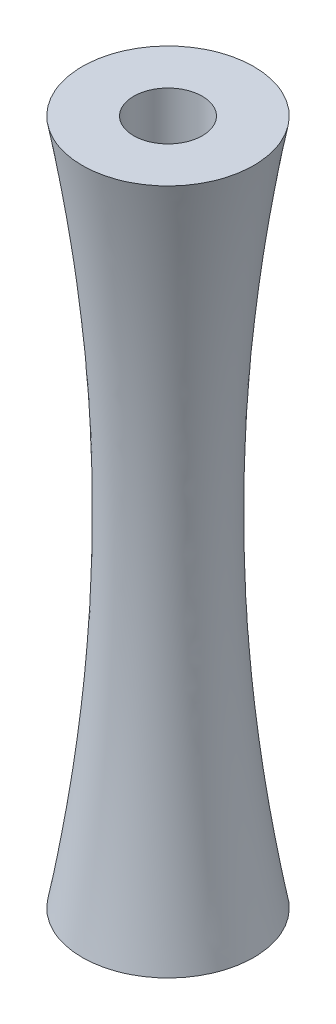
ISO-10303-21;
HEADER;
FILE_DESCRIPTION(('STEP AP214'),'2;1');
FILE_NAME('part.step','',(''),(''),'','','');
FILE_SCHEMA(('AUTOMOTIVE_DESIGN { 1 0 10303 214 1 1 1 1 }'));
ENDSEC;
DATA;
#1=APPLICATION_CONTEXT('core data for automotive mechanical design processes');
#2=APPLICATION_PROTOCOL_DEFINITION('international standard','automotive_design',2000,#1);
#3=PRODUCT_CONTEXT('',#1,'mechanical');
#4=PRODUCT('Part','Part','',(#3));
#5=PRODUCT_RELATED_PRODUCT_CATEGORY('part','',(#4));
#6=PRODUCT_DEFINITION_FORMATION('','',#4);
#7=PRODUCT_DEFINITION_CONTEXT('part definition',#1,'design');
#8=PRODUCT_DEFINITION('design','',#6,#7);
#9=PRODUCT_DEFINITION_SHAPE('','',#8);
#10=(LENGTH_UNIT() NAMED_UNIT(*) SI_UNIT(.MILLI.,.METRE.));
#11=(NAMED_UNIT(*) PLANE_ANGLE_UNIT() SI_UNIT($,.RADIAN.));
#12=(NAMED_UNIT(*) SI_UNIT($,.STERADIAN.) SOLID_ANGLE_UNIT());
#13=UNCERTAINTY_MEASURE_WITH_UNIT(LENGTH_MEASURE(1.E-05),#10,'distance_accuracy_value','');
#14=(GEOMETRIC_REPRESENTATION_CONTEXT(3) GLOBAL_UNCERTAINTY_ASSIGNED_CONTEXT((#13)) GLOBAL_UNIT_ASSIGNED_CONTEXT((#10,
#11,#12)) REPRESENTATION_CONTEXT('',''));
#15=CARTESIAN_POINT('',(0.,0.,0.));
#16=DIRECTION('',(0.,0.,1.));
#17=DIRECTION('',(1.,0.,0.));
#18=AXIS2_PLACEMENT_3D('',#15,#16,#17);
#19=CARTESIAN_POINT('',(0.,60.,0.));
#20=DIRECTION('',(0.,1.,0.));
#21=DIRECTION('',(0.,0.,1.));
#22=AXIS2_PLACEMENT_3D('',#19,#20,#21);
#23=PLANE('',#22);
#24=CARTESIAN_POINT('',(0.,60.,0.));
#25=DIRECTION('',(0.,1.,0.));
#26=DIRECTION('',(0.,0.,1.));
#27=AXIS2_PLACEMENT_3D('',#24,#25,#26);
#28=CIRCLE('',#27,3.);
#29=CARTESIAN_POINT('',(0.,60.,3.));
#30=VERTEX_POINT('',#29);
#31=EDGE_CURVE('E103',#30,#30,#28,.T.);
#32=ORIENTED_EDGE('',*,*,#31,.F.);
#33=EDGE_LOOP('',(#32));
#34=FACE_BOUND('',#33,.T.);
#35=CARTESIAN_POINT('',(0.,60.,0.));
#36=DIRECTION('',(0.,1.,0.));
#37=DIRECTION('',(0.,0.,1.));
#38=AXIS2_PLACEMENT_3D('',#35,#36,#37);
#39=CIRCLE('',#38,7.5);
#40=CARTESIAN_POINT('',(0.,60.,7.5));
#41=VERTEX_POINT('',#40);
#42=EDGE_CURVE('E11',#41,#41,#39,.T.);
#43=ORIENTED_EDGE('',*,*,#42,.T.);
#44=EDGE_LOOP('',(#43));
#45=FACE_BOUND('',#44,.T.);
#46=ADVANCED_FACE('F88',(#34,#45),#23,.T.);
#47=CARTESIAN_POINT('',(0.,0.,0.));
#48=DIRECTION('',(0.,1.,0.));
#49=DIRECTION('',(0.,0.,1.));
#50=AXIS2_PLACEMENT_3D('',#47,#48,#49);
#51=PLANE('',#50);
#52=CARTESIAN_POINT('',(0.,0.,0.));
#53=DIRECTION('',(0.,-1.,0.));
#54=DIRECTION('',(0.,0.,-1.));
#55=AXIS2_PLACEMENT_3D('',#52,#53,#54);
#56=CIRCLE('',#55,3.);
#57=CARTESIAN_POINT('',(0.,0.,-3.));
#58=VERTEX_POINT('',#57);
#59=EDGE_CURVE('E167',#58,#58,#56,.T.);
#60=ORIENTED_EDGE('',*,*,#59,.F.);
#61=EDGE_LOOP('',(#60));
#62=FACE_BOUND('',#61,.T.);
#63=CARTESIAN_POINT('',(0.,0.,0.));
#64=DIRECTION('',(0.,1.,0.));
#65=DIRECTION('',(0.,0.,1.));
#66=AXIS2_PLACEMENT_3D('',#63,#64,#65);
#67=CIRCLE('',#66,7.5);
#68=CARTESIAN_POINT('',(0.,0.,7.5));
#69=VERTEX_POINT('',#68);
#70=EDGE_CURVE('E97',#69,#69,#67,.T.);
#71=ORIENTED_EDGE('',*,*,#70,.F.);
#72=EDGE_LOOP('',(#71));
#73=FACE_BOUND('',#72,.T.);
#74=ADVANCED_FACE('F122',(#62,#73),#51,.F.);
#75=CARTESIAN_POINT('',(0.,0.,7.5));
#76=CARTESIAN_POINT('',(0.,6.64072632944228,6.25162127107653));
#77=CARTESIAN_POINT('',(0.,19.9017616439387,4.58708576383651));
#78=CARTESIAN_POINT('',(0.,40.0982383560613,4.5870857638365));
#79=CARTESIAN_POINT('',(0.,53.3592736705577,6.25162127107652));
#80=CARTESIAN_POINT('',(0.,60.,7.5));
#81=CARTESIAN_POINT('',(0.981747644821663,0.,7.5));
#82=CARTESIAN_POINT('',(0.818357373551676,6.64072632944228,6.25162127107653));
#83=CARTESIAN_POINT('',(0.600440791098656,19.9017616439387,4.58708576383651));
#84=CARTESIAN_POINT('',(0.600440791098657,40.0982383560613,4.58708576383651));
#85=CARTESIAN_POINT('',(0.818357373551675,53.3592736705577,6.25162127107652));
#86=CARTESIAN_POINT('',(0.981747644821663,60.,7.5));
#87=CARTESIAN_POINT('',(2.94482192138882,0.,7.10994749537243));
#88=CARTESIAN_POINT('',(2.45465110757885,6.64072383996429,5.92649931678231));
#89=CARTESIAN_POINT('',(1.80110525290804,19.9017631268565,4.34853905308531));
#90=CARTESIAN_POINT('',(1.80110525290804,40.0982368731434,4.34853905308531));
#91=CARTESIAN_POINT('',(2.45465110757885,53.3592761600357,5.92649931678231));
#92=CARTESIAN_POINT('',(2.94482192138882,60.,7.10994749537243));
#93=CARTESIAN_POINT('',(5.44166129928465,0.,5.44146013449238));
#94=CARTESIAN_POINT('',(4.53586462026115,6.64072384623036,4.53572733587199));
#95=CARTESIAN_POINT('',(3.32810591228955,19.901763123124,3.32806116946585));
#96=CARTESIAN_POINT('',(3.32810591228955,40.0982368768761,3.32806116946585));
#97=CARTESIAN_POINT('',(4.53586462026114,53.3592761537697,4.53572733587198));
#98=CARTESIAN_POINT('',(5.44166129928465,60.0000000000001,5.44146013449238));
#99=CARTESIAN_POINT('',(7.10969915199535,0.,2.94496975546454));
#100=CARTESIAN_POINT('',(5.926286241772,6.64072493633441,2.45480405711622));
#101=CARTESIAN_POINT('',(4.34837515630249,19.9017624737771,1.80123771160252));
#102=CARTESIAN_POINT('',(4.34837515630248,40.0982375262228,1.80123771160252));
#103=CARTESIAN_POINT('',(5.926286241772,53.3592750636655,2.45480405711622));
#104=CARTESIAN_POINT('',(7.10969915199535,59.9999999999999,2.94496975546454));
#105=CARTESIAN_POINT('',(7.69554063634128,0.,-2.67619228474895E-05));
#106=CARTESIAN_POINT('',(6.41461225339653,6.64072424410573,-2.73075102060959E-05));
#107=CARTESIAN_POINT('',(4.70667553411878,19.9017628861199,-2.80338664006645E-05));
#108=CARTESIAN_POINT('',(4.70667553411877,40.0982371138801,-2.80338664001364E-05));
#109=CARTESIAN_POINT('',(6.41461225339653,53.3592757558943,-2.73075102069825E-05));
#110=CARTESIAN_POINT('',(7.69554063634127,60.,-2.67619228474895E-05));
#111=CARTESIAN_POINT('',(7.10971578776931,0.,-2.94490446267548));
#112=CARTESIAN_POINT('',(5.92630181071778,6.64072493870547,-2.45473821202761));
#113=CARTESIAN_POINT('',(4.34838747738739,19.9017624723648,-1.80117113452925));
#114=CARTESIAN_POINT('',(4.34838747738739,40.0982375276353,-1.80117113452925));
#115=CARTESIAN_POINT('',(5.92630181071778,53.3592750612946,-2.4547382120276));
#116=CARTESIAN_POINT('',(7.10971578776931,60.0000000000001,-2.94490446267548));
#117=CARTESIAN_POINT('',(5.44161746602329,0.,-5.44157367593528));
#118=CARTESIAN_POINT('',(4.53582471749693,6.64072371496753,-4.53583514124079));
#119=CARTESIAN_POINT('',(3.32807853314484,19.9017632013138,-3.32816130333773));
#120=CARTESIAN_POINT('',(3.32807853314484,40.0982367986861,-3.32816130333773));
#121=CARTESIAN_POINT('',(4.53582471749693,53.3592762850324,-4.53583514124079));
#122=CARTESIAN_POINT('',(5.44161746602329,59.9999999999999,-5.44157367593528));
#123=CARTESIAN_POINT('',(2.94491624384262,0.,-7.10972919973185));
#124=CARTESIAN_POINT('',(2.45473844623964,6.64072442991887,-5.92629913830792));
#125=CARTESIAN_POINT('',(1.80115598155029,19.9017627754358,-4.34836312779551));
#126=CARTESIAN_POINT('',(1.80115598155029,40.0982372245642,-4.34836312779551));
#127=CARTESIAN_POINT('',(2.45473844623964,53.3592755700813,-5.92629913830792));
#128=CARTESIAN_POINT('',(2.94491624384262,60.0000000000002,-7.10972919973185));
#129=CARTESIAN_POINT('',(0.,0.,-7.69551250799886));
#130=CARTESIAN_POINT('',(0.,6.64072592199922,-6.41462674512618));
#131=CARTESIAN_POINT('',(0.,19.901761886642,-4.7067476625407));
#132=CARTESIAN_POINT('',(0.,40.0982381133578,-4.7067476625407));
#133=CARTESIAN_POINT('',(0.,53.3592740780006,-6.41462674512618));
#134=CARTESIAN_POINT('',(0.,59.9999999999999,-7.69551250799886));
#135=CARTESIAN_POINT('',(-2.94491624384264,0.,-7.10972919973187));
#136=CARTESIAN_POINT('',(-2.45473844623965,6.64072442991889,-5.92629913830794));
#137=CARTESIAN_POINT('',(-1.80115598155027,19.9017627754359,-4.34836312779553));
#138=CARTESIAN_POINT('',(-1.80115598155028,40.0982372245645,-4.34836312779554));
#139=CARTESIAN_POINT('',(-2.45473844623965,53.3592755700813,-5.92629913830793));
#140=CARTESIAN_POINT('',(-2.94491624384264,60.0000000000001,-7.10972919973187));
#141=CARTESIAN_POINT('',(-5.4416174660233,0.,-5.44157367593527));
#142=CARTESIAN_POINT('',(-4.53582471749692,6.6407237149675,-4.53583514124079));
#143=CARTESIAN_POINT('',(-3.32807853314482,19.9017632013138,-3.32816130333774));
#144=CARTESIAN_POINT('',(-3.32807853314481,40.0982367986859,-3.32816130333774));
#145=CARTESIAN_POINT('',(-4.53582471749693,53.3592762850324,-4.53583514124079));
#146=CARTESIAN_POINT('',(-5.4416174660233,59.9999999999999,-5.44157367593527));
#147=CARTESIAN_POINT('',(-7.1097157877693,0.,-2.94490446267547));
#148=CARTESIAN_POINT('',(-5.92630181071777,6.64072493870549,-2.45473821202761));
#149=CARTESIAN_POINT('',(-4.34838747738738,19.9017624723648,-1.80117113452928));
#150=CARTESIAN_POINT('',(-4.34838747738738,40.0982375276355,-1.80117113452928));
#151=CARTESIAN_POINT('',(-5.92630181071776,53.3592750612946,-2.45473821202761));
#152=CARTESIAN_POINT('',(-7.10971578776929,60.0000000000001,-2.94490446267547));
#153=CARTESIAN_POINT('',(-7.69554063634129,0.,-2.67619228362138E-05));
#154=CARTESIAN_POINT('',(-6.41461225339654,6.6407242441057,-2.73075102087398E-05));
#155=CARTESIAN_POINT('',(-4.70667553411878,19.9017628861198,-2.80338664210188E-05));
#156=CARTESIAN_POINT('',(-4.70667553411878,40.0982371138799,-2.80338664209986E-05));
#157=CARTESIAN_POINT('',(-6.41461225339654,53.3592757558941,-2.73075102087736E-05));
#158=CARTESIAN_POINT('',(-7.69554063634128,59.9999999999998,-2.67619228362138E-05));
#159=CARTESIAN_POINT('',(-7.10969915199534,0.,2.94496975546455));
#160=CARTESIAN_POINT('',(-5.92628624177201,6.64072493633445,2.45480405711621));
#161=CARTESIAN_POINT('',(-4.34837515630249,19.9017624737772,1.8012377116025));
#162=CARTESIAN_POINT('',(-4.3483751563025,40.098237526223,1.80123771160251));
#163=CARTESIAN_POINT('',(-5.926286241772,53.3592750636658,2.45480405711621));
#164=CARTESIAN_POINT('',(-7.10969915199534,60.0000000000001,2.94496975546455));
#165=CARTESIAN_POINT('',(-5.44166129928467,0.,5.44146013449239));
#166=CARTESIAN_POINT('',(-4.53586462026115,6.64072384623035,4.53572733587199));
#167=CARTESIAN_POINT('',(-3.32810591228956,19.901763123124,3.32806116946584));
#168=CARTESIAN_POINT('',(-3.32810591228955,40.0982368768761,3.32806116946584));
#169=CARTESIAN_POINT('',(-4.53586462026115,53.3592761537696,4.53572733587199));
#170=CARTESIAN_POINT('',(-5.44166129928467,59.9999999999999,5.44146013449239));
#171=CARTESIAN_POINT('',(-2.94482192138881,0.,7.10994749537242));
#172=CARTESIAN_POINT('',(-2.45465110757886,6.64072383996429,5.9264993167823));
#173=CARTESIAN_POINT('',(-1.80110525290805,19.9017631268565,4.34853905308532));
#174=CARTESIAN_POINT('',(-1.80110525290805,40.0982368731434,4.34853905308532));
#175=CARTESIAN_POINT('',(-2.45465110757885,53.3592761600358,5.9264993167823));
#176=CARTESIAN_POINT('',(-2.94482192138881,60.,7.10994749537242));
#177=CARTESIAN_POINT('',(-0.981747644821663,0.,7.5));
#178=CARTESIAN_POINT('',(-0.818357373551675,6.64072632944228,6.25162127107653));
#179=CARTESIAN_POINT('',(-0.600440791098657,19.9017616439387,4.58708576383651));
#180=CARTESIAN_POINT('',(-0.600440791098656,40.0982383560612,4.5870857638365));
#181=CARTESIAN_POINT('',(-0.818357373551675,53.3592736705577,6.25162127107652));
#182=CARTESIAN_POINT('',(-0.981747644821663,60.,7.5));
#183=CARTESIAN_POINT('',(0.,0.,7.5));
#184=CARTESIAN_POINT('',(0.,6.64072632944228,6.25162127107653));
#185=CARTESIAN_POINT('',(0.,19.9017616439387,4.58708576383651));
#186=CARTESIAN_POINT('',(0.,40.0982383560613,4.5870857638365));
#187=CARTESIAN_POINT('',(0.,53.3592736705577,6.25162127107652));
#188=CARTESIAN_POINT('',(0.,60.,7.5));
#189=B_SPLINE_SURFACE_WITH_KNOTS('',3,3,((#75,#76,#77,#78,#79,#80),(#81,#82,#83,#84,#85,#86),
(#87,#88,#89,#90,#91,#92),(#93,#94,#95,#96,#97,#98),(#99,#100,#101,#102,#103,#104),(#105,#106,
#107,#108,#109,#110),(#111,#112,#113,#114,#115,#116),(#117,#118,#119,#120,#121,#122),(#123,#124,
#125,#126,#127,#128),(#129,#130,#131,#132,#133,#134),(#135,#136,#137,#138,#139,#140),(#141,#142,
#143,#144,#145,#146),(#147,#148,#149,#150,#151,#152),(#153,#154,#155,#156,#157,#158),(#159,#160,
#161,#162,#163,#164),(#165,#166,#167,#168,#169,#170),(#171,#172,#173,#174,#175,#176),(#177,#178,
#179,#180,#181,#182),(#183,#184,#185,#186,#187,#188)),.UNSPECIFIED.,.T.,.F.,.F.,(4,1,1,1,1,1,1,
1,1,1,1,1,1,1,1,1,4),(4,1,1,4),(0.,0.0625,0.125,0.1875,0.25,0.3125,0.375,0.4375,0.5,0.5625,
0.625,0.6875,0.75,0.8125,0.875,0.9375,1.),(0.,0.334193561293937,0.665806438706063,1.),.UNSPECIFIED.);
#190=CARTESIAN_POINT('',(0.,0.,7.5));
#191=CARTESIAN_POINT('',(0.,0.0776125402742504,7.48540975171107));
#192=CARTESIAN_POINT('',(0.,0.155235393256961,7.47087436076974));
#193=CARTESIAN_POINT('',(0.,0.310485436550854,7.44191644167547));
#194=CARTESIAN_POINT('',(0.,0.388112622599399,7.4274938906695));
#195=CARTESIAN_POINT('',(0.,0.543371432193753,7.39876167207162));
#196=CARTESIAN_POINT('',(0.,0.621003051571173,7.38445198195527));
#197=CARTESIAN_POINT('',(0.,0.776270827807163,7.35594550543869));
#198=CARTESIAN_POINT('',(0.,0.853906980590911,7.34174869684396));
#199=CARTESIAN_POINT('',(0.,1.00918392367389,7.31346800375774));
#200=CARTESIAN_POINT('',(0.,1.08682470999112,7.29938409740292));
#201=CARTESIAN_POINT('',(0.,1.24211102016281,7.2713292291593));
#202=CARTESIAN_POINT('',(0.,1.31975654012736,7.25735824573959));
#203=CARTESIAN_POINT('',(0.,1.47505241761974,7.22952924373386));
#204=CARTESIAN_POINT('',(0.,1.55270277134901,7.21567120395062));
#205=CARTESIAN_POINT('',(0.,1.70800841639666,7.18806810958264));
#206=CARTESIAN_POINT('',(0.,1.78566370400708,7.17432303413557));
#207=CARTESIAN_POINT('',(0.,1.94097931684388,7.14694588880395));
#208=CARTESIAN_POINT('',(0.,2.01863963845214,7.1333137983932));
#209=CARTESIAN_POINT('',(0.,2.17396541931215,7.10616264349688));
#210=CARTESIAN_POINT('',(0.,2.25163087503485,7.09264355882246));
#211=CARTESIAN_POINT('',(0.,2.40696702415208,7.06571843576029));
#212=CARTESIAN_POINT('',(0.,2.48463771410585,7.05231237752224));
#213=CARTESIAN_POINT('',(0.,2.63998443171431,7.0256133276931));
#214=CARTESIAN_POINT('',(0.,2.71766045601575,7.01232031659145));
#215=CARTESIAN_POINT('',(0.,2.87301794234945,6.9858473813942));
#216=CARTESIAN_POINT('',(0.,2.95069940111518,6.97266743812897));
#217=CARTESIAN_POINT('',(0.,3.10606785640812,6.94642065896248));
#218=CARTESIAN_POINT('',(0.,3.18375484975473,6.93335380423368));
#219=CARTESIAN_POINT('',(0.,3.3391344742409,6.90733322249681));
#220=CARTESIAN_POINT('',(0.,3.416827102285,6.89437947700444));
#221=CARTESIAN_POINT('',(0.,3.5722180961984,6.86858513409604));
#222=CARTESIAN_POINT('',(0.,3.64991645905656,6.85574451854012));
#223=CARTESIAN_POINT('',(0.,3.80531902263119,6.83017645585905));
#224=CARTESIAN_POINT('',(0.,3.88302322041999,6.81744899093956));
#225=CARTESIAN_POINT('',(0.,4.03843755388983,6.79210724988467));
#226=CARTESIAN_POINT('',(0.,4.11614768672586,6.7794929563016));
#227=CARTESIAN_POINT('',(0.,4.27157399032488,6.75437757827174));
#228=CARTESIAN_POINT('',(0.,4.3492901583247,6.74187647672507));
#229=CARTESIAN_POINT('',(0.,4.50472863228689,6.71698750311907));
#230=CARTESIAN_POINT('',(0.,4.58245093556707,6.70459961430877));
#231=CARTESIAN_POINT('',(0.,4.7379017801264,6.67993708652549));
#232=CARTESIAN_POINT('',(0.,4.81563031880349,6.66766243115153));
#233=CARTESIAN_POINT('',(0.,4.97109373419392,6.6432263905898));
#234=CARTESIAN_POINT('',(0.,5.04882860838449,6.63106498935213));
#235=CARTESIAN_POINT('',(0.,5.20430479483998,6.60685547741078));
#236=CARTESIAN_POINT('',(0.,5.28204610466057,6.59480735100936));
#237=CARTESIAN_POINT('',(0.,5.43753526241508,6.57082440908723));
#238=CARTESIAN_POINT('',(0.,5.51528310798223,6.558889578222));
#239=CARTESIAN_POINT('',(0.,5.67078543726973,6.53513324771792));
#240=CARTESIAN_POINT('',(0.,5.74853991869998,6.5233117330888));
#241=CARTESIAN_POINT('',(0.,5.9040556197544,6.49978205540159));
#242=CARTESIAN_POINT('',(0.,5.98181683716428,6.48807387770853));
#243=CARTESIAN_POINT('',(0.,6.13734611021958,6.46477089423701));
#244=CARTESIAN_POINT('',(0.,6.21511416372562,6.45317607417993));
#245=CARTESIAN_POINT('',(0.,6.37065720901573,6.43009982632292));
#246=CARTESIAN_POINT('',(0.,6.44843219873445,6.41861838460172));
#247=CARTESIAN_POINT('',(0.,6.60398921649332,6.39576891375804));
#248=CARTESIAN_POINT('',(0.,6.68177124254123,6.38440087107262));
#249=CARTESIAN_POINT('',(0.,6.83734243300279,6.36177821864109));
#250=CARTESIAN_POINT('',(0.,6.9151315954964,6.35052359569135));
#251=CARTESIAN_POINT('',(0.,7.07071715889458,6.32812780307076));
#252=CARTESIAN_POINT('',(0.,7.14851355795041,6.31698662055661));
#253=CARTESIAN_POINT('',(0.,7.30411369451913,6.29481772914577));
#254=CARTESIAN_POINT('',(0.,7.38191743025366,6.28379000776707));
#255=CARTESIAN_POINT('',(0.,7.53753234022685,6.26184805896479));
#256=CARTESIAN_POINT('',(0.,7.61534351275659,6.25093381942142));
#257=CARTESIAN_POINT('',(0.,7.77097339636817,6.22921885462649));
#258=CARTESIAN_POINT('',(0.,7.8487921058096,6.21841811761831));
#259=CARTESIAN_POINT('',(0.,8.00443716329347,6.19693017822953));
#260=CARTESIAN_POINT('',(0.,8.08226350976309,6.1862429644564));
#261=CARTESIAN_POINT('',(0.,8.23792394135317,6.16498209187255));
#262=CARTESIAN_POINT('',(0.,8.31575802496745,6.15440842203433));
#263=CARTESIAN_POINT('',(0.,8.47143403089765,6.13337465765421));
#264=CARTESIAN_POINT('',(0.,8.54927595177306,6.12291455245072));
#265=CARTESIAN_POINT('',(0.,8.70496773227728,6.1021079376731));
#266=CARTESIAN_POINT('',(0.,8.7828175905303,6.09176141780419));
#267=CARTESIAN_POINT('',(0.,8.93852534584244,6.07118199402786));
#268=CARTESIAN_POINT('',(0.,9.01638324158953,6.06094908019335));
#269=CARTESIAN_POINT('',(0.,9.17210717194349,6.04059688881707));
#270=CARTESIAN_POINT('',(0.,9.24997320530111,6.03047760171678));
#271=CARTESIAN_POINT('',(0.,9.40571351093078,6.01035268413934));
#272=CARTESIAN_POINT('',(0.,9.48358778201539,6.00034704447306));
#273=CARTESIAN_POINT('',(0.,9.63934466315466,5.98044944209322));
#274=CARTESIAN_POINT('',(0.,9.71722727208271,5.97055747056077));
#275=CARTESIAN_POINT('',(0.,9.87300092896546,5.95088722477729));
#276=CARTESIAN_POINT('',(0.,9.9508919758534,5.94110894207845));
#277=CARTESIAN_POINT('',(0.,10.1066826087135,5.9216660942901));
#278=CARTESIAN_POINT('',(0.,10.1845821936778,5.91200152112465));
#279=CARTESIAN_POINT('',(0.,10.3403900027491,5.89278611273018));
#280=CARTESIAN_POINT('',(0.,10.4182982259062,5.88323526979789));
#281=CARTESIAN_POINT('',(0.,10.5741234114227,5.86424734219605));
#282=CARTESIAN_POINT('',(0.,10.6520403728889,5.8548102501967));
#283=CARTESIAN_POINT('',(0.,10.8078831350844,5.83604984478624));
#284=CARTESIAN_POINT('',(0.,10.8858089349763,5.82672652441957));
#285=CARTESIAN_POINT('',(0.,11.0416694740846,5.80819368259924));
#286=CARTESIAN_POINT('',(0.,11.1196042125185,5.79898415456501));
#287=CARTESIAN_POINT('',(0.,11.2754827287736,5.78067891773355));
#288=CARTESIAN_POINT('',(0.,11.353426505866,5.77158320273147));
#289=CARTESIAN_POINT('',(0.,11.5093231995017,5.75350561228762));
#290=CARTESIAN_POINT('',(0.,11.587276115369,5.74452373101745));
#291=CARTESIAN_POINT('',(0.,11.7431911866191,5.72667382835993));
#292=CARTESIAN_POINT('',(0.,11.8211533413777,5.71780580152137));
#293=CARTESIAN_POINT('',(0.,11.9770869904761,5.70018362804892));
#294=CARTESIAN_POINT('',(0.,12.0550584842425,5.6914294763417));
#295=CARTESIAN_POINT('',(0.,12.211010911423,5.67403507345303));
#296=CARTESIAN_POINT('',(0.,12.2889918443135,5.66539481757684));
#297=CARTESIAN_POINT('',(0.,12.4449632498101,5.64822822667068));
#298=CARTESIAN_POINT('',(0.,12.5229537219411,5.63970188732522));
#299=CARTESIAN_POINT('',(0.,12.6789443059875,5.62276314980029));
#300=CARTESIAN_POINT('',(0.,12.7569444174755,5.61435074768523));
#301=CARTESIAN_POINT('',(0.,12.9129543803056,5.59763990494023));
#302=CARTESIAN_POINT('',(0.,12.9909642312669,5.58934146075526));
#303=CARTESIAN_POINT('',(0.,13.1469937731145,5.57285855418891));
#304=CARTESIAN_POINT('',(0.,13.2250134636655,5.56467408863368));
#305=CARTESIAN_POINT('',(0.,13.3810627847645,5.54841915964468));
#306=CARTESIAN_POINT('',(0.,13.4590924150217,5.54034869341885));
#307=CARTESIAN_POINT('',(0.,13.6151617156059,5.5243217834059));
#308=CARTESIAN_POINT('',(0.,13.6932013856855,5.51636533720913));
#309=CARTESIAN_POINT('',(0.,13.8492908659887,5.50056648757092));
#310=CARTESIAN_POINT('',(0.,13.9273406760072,5.49272408210283));
#311=CARTESIAN_POINT('',(0.,14.0834505362634,5.47715333423805));
#312=CARTESIAN_POINT('',(0.,14.1615105863371,5.46942499019828));
#313=CARTESIAN_POINT('',(0.,14.31764102678,5.45408238550562));
#314=CARTESIAN_POINT('',(0.,14.3957114170253,5.44646812359378));
#315=CARTESIAN_POINT('',(0.,14.5518626378887,5.43135370347193));
#316=CARTESIAN_POINT('',(0.,14.629943468422,5.42385354438763));
#317=CARTESIAN_POINT('',(0.,14.7861156699398,5.40896735023526));
#318=CARTESIAN_POINT('',(0.,14.8642070408775,5.40158131467811));
#319=CARTESIAN_POINT('',(0.,15.0204004232834,5.38692338789388));
#320=CARTESIAN_POINT('',(0.,15.0985024347418,5.37965149656346));
#321=CARTESIAN_POINT('',(0.,15.2547171982697,5.36522187854605));
#322=CARTESIAN_POINT('',(0.,15.3328299503653,5.35806415214195));
#323=CARTESIAN_POINT('',(0.,15.4890662952489,5.34386288429003));
#324=CARTESIAN_POINT('',(0.,15.5671898880979,5.33681934351181));
#325=CARTESIAN_POINT('',(0.,15.7234480145713,5.32284646722404));
#326=CARTESIAN_POINT('',(0.,15.8015825482901,5.31591713277127));
#327=CARTESIAN_POINT('',(0.,15.9578626565868,5.30217268944629));
#328=CARTESIAN_POINT('',(0.,16.0360082312918,5.29535758201851));
#329=CARTESIAN_POINT('',(0.,16.1923105216457,5.28184161305499));
#330=CARTESIAN_POINT('',(0.,16.2704672374532,5.27514075335176));
#331=CARTESIAN_POINT('',(0.,16.4267919100982,5.26185330014833));
#332=CARTESIAN_POINT('',(0.,16.5049598671246,5.25526670886917));
#333=CARTESIAN_POINT('',(0.,16.6613071222945,5.24220781282447));
#334=CARTESIAN_POINT('',(0.,16.739486420656,5.23573551066891));
#335=CARTESIAN_POINT('',(0.,16.8958564585845,5.2229052131816));
#336=CARTESIAN_POINT('',(0.,16.9740471983976,5.21654722084914));
#337=CARTESIAN_POINT('',(0.,17.1304402193186,5.20394556331784));
#338=CARTESIAN_POINT('',(0.,17.2086425006996,5.19770190150799));
#339=CARTESIAN_POINT('',(0.,17.3650587048468,5.18532892533132));
#340=CARTESIAN_POINT('',(0.,17.4432726279121,5.17919961474358));
#341=CARTESIAN_POINT('',(0.,17.5997122155194,5.16705536132017));
#342=CARTESIAN_POINT('',(0.,17.6779378803851,5.16104042265402));
#343=CARTESIAN_POINT('',(0.,17.8344010516863,5.14912493338248));
#344=CARTESIAN_POINT('',(0.,17.912638558469,5.14322438733737));
#345=CARTESIAN_POINT('',(0.,18.0691255136978,5.13153770361639));
#346=CARTESIAN_POINT('',(0.,18.1473749625137,5.12575157089189));
#347=CARTESIAN_POINT('',(0.,18.3038859019039,5.11429373411977));
#348=CARTESIAN_POINT('',(0.,18.3821473928694,5.10862203541491));
#349=CARTESIAN_POINT('',(0.,18.5386825166549,5.09739308699141));
#350=CARTESIAN_POINT('',(0.,18.6169561498863,5.09183584300721));
#351=CARTESIAN_POINT('',(0.,18.7735156583006,5.08083582432665));
#352=CARTESIAN_POINT('',(0.,18.8518015339139,5.0753930557567));
#353=CARTESIAN_POINT('',(0.,19.0083856271918,5.06462200823361));
#354=CARTESIAN_POINT('',(0.,19.0866838453048,5.05929373579909));
#355=CARTESIAN_POINT('',(0.,19.2432927236764,5.04875170077263));
#356=CARTESIAN_POINT('',(0.,19.3216033844002,5.0435379450918));
#357=CARTESIAN_POINT('',(0.,19.478237248113,5.0332249641823));
#358=CARTESIAN_POINT('',(0.,19.5565604515829,5.02812574625746));
#359=CARTESIAN_POINT('',(0.,19.7132195008194,5.01804186003594));
#360=CARTESIAN_POINT('',(0.,19.7915553470814,5.01305719943593));
#361=CARTESIAN_POINT('',(0.,19.9482397763526,5.00320245276174));
#362=CARTESIAN_POINT('',(0.,20.0265883598701,4.99833237476895));
#363=CARTESIAN_POINT('',(0.,20.1832981790801,4.98870680508653));
#364=CARTESIAN_POINT('',(0.,20.2616594152766,4.98395132160103));
#365=CARTESIAN_POINT('',(0.,20.4183942493215,4.97455493556707));
#366=CARTESIAN_POINT('',(0.,20.496767847651,4.96991404104381));
#367=CARTESIAN_POINT('',(0.,20.6535271045492,4.96074683442519));
#368=CARTESIAN_POINT('',(0.,20.7319127635758,4.95622053015999));
#369=CARTESIAN_POINT('',(0.,20.8886958403522,4.94728250390532));
#370=CARTESIAN_POINT('',(0.,20.9670932585372,4.9428707895508));
#371=CARTESIAN_POINT('',(0.,21.1238995521413,4.9341619434057));
#372=CARTESIAN_POINT('',(0.,21.2023084279735,4.92986481905483));
#373=CARTESIAN_POINT('',(0.,21.359137335375,4.92138515308726));
#374=CARTESIAN_POINT('',(0.,21.4375573673359,4.91720261871501));
#375=CARTESIAN_POINT('',(0.,21.594408285499,4.9089521329066));
#376=CARTESIAN_POINT('',(0.,21.672839172072,4.90488418851956));
#377=CARTESIAN_POINT('',(0.,21.8297114979625,4.89686288287506));
#378=CARTESIAN_POINT('',(0.,21.9081529376305,4.89290952847135));
#379=CARTESIAN_POINT('',(0.,22.0650460682138,4.88511740298932));
#380=CARTESIAN_POINT('',(0.,22.1434977594598,4.88127863856934));
#381=CARTESIAN_POINT('',(0.,22.3004110917013,4.87371569324999));
#382=CARTESIAN_POINT('',(0.,22.3788727330083,4.86999151881353));
#383=CARTESIAN_POINT('',(0.,22.5358056638734,4.86265775365666));
#384=CARTESIAN_POINT('',(0.,22.6142769537244,4.85904816920368));
#385=CARTESIAN_POINT('',(0.,22.7712288801787,4.85194358420917));
#386=CARTESIAN_POINT('',(0.,22.8497095170567,4.84844858973958));
#387=CARTESIAN_POINT('',(0.,23.0066798360654,4.84157318490733));
#388=CARTESIAN_POINT('',(0.,23.0851695184535,4.83819278042106));
#389=CARTESIAN_POINT('',(0.,23.2421576269822,4.83154655575095));
#390=CARTESIAN_POINT('',(0.,23.3206560533633,4.82828074124792));
#391=CARTESIAN_POINT('',(0.,23.4776613483773,4.82186369673984));
#392=CARTESIAN_POINT('',(0.,23.5561682172344,4.81871247222));
#393=CARTESIAN_POINT('',(0.,23.7131900956993,4.81252460787384));
#394=CARTESIAN_POINT('',(0.,23.7917051055154,4.80948797333711));
#395=CARTESIAN_POINT('',(0.,23.9487429643965,4.80352928915278));
#396=CARTESIAN_POINT('',(0.,24.0272658136546,4.80060724459909));
#397=CARTESIAN_POINT('',(0.,24.1843190499173,4.79487774057649));
#398=CARTESIAN_POINT('',(0.,24.2628494371005,4.79207028600579));
#399=CARTESIAN_POINT('',(0.,24.4199174477103,4.78656996214483));
#400=CARTESIAN_POINT('',(0.,24.4984550713016,4.78387709755706));
#401=CARTESIAN_POINT('',(0.,24.6555372532239,4.77860595385764));
#402=CARTESIAN_POINT('',(0.,24.7340818117062,4.77602767925273));
#403=CARTESIAN_POINT('',(0.,24.8911775619064,4.77098571571477));
#404=CARTESIAN_POINT('',(0.,24.9697287537627,4.76852203109269));
#405=CARTESIAN_POINT('',(0.,25.1268374692063,4.7637092477161));
#406=CARTESIAN_POINT('',(0.,25.2053949929196,4.76136015307678));
#407=CARTESIAN_POINT('',(0.,25.362516070572,4.7567765498615));
#408=CARTESIAN_POINT('',(0.,25.4410796246254,4.75454204520489));
#409=CARTESIAN_POINT('',(0.,25.598212461452,4.75018762215083));
#410=CARTESIAN_POINT('',(0.,25.6767817443284,4.7480677074769));
#411=CARTESIAN_POINT('',(0.,25.8339257372947,4.74394246458399));
#412=CARTESIAN_POINT('',(0.,25.9125004474771,4.74193713989268));
#413=CARTESIAN_POINT('',(0.,26.0696549935484,4.73804107716086));
#414=CARTESIAN_POINT('',(0.,26.1482348295199,4.73615034245214));
#415=CARTESIAN_POINT('',(0.,26.3053993256617,4.73248345988134));
#416=CARTESIAN_POINT('',(0.,26.3839839859052,4.73070731515516));
#417=CARTESIAN_POINT('',(0.,26.541157829083,4.72726961274532));
#418=CARTESIAN_POINT('',(0.,26.6197470120815,4.72560805800165));
#419=CARTESIAN_POINT('',(0.,26.7769295992606,4.72239953575272));
#420=CARTESIAN_POINT('',(0.,26.8555230034971,4.72085257099151));
#421=CARTESIAN_POINT('',(0.,27.012713731643,4.71787322890344));
#422=CARTESIAN_POINT('',(0.,27.0913110556006,4.71644085412468));
#423=CARTESIAN_POINT('',(0.,27.2485093216786,4.71369069219741));
#424=CARTESIAN_POINT('',(0.,27.3271102638403,4.71237290740106));
#425=CARTESIAN_POINT('',(0.,27.4843154648159,4.70985192563456));
#426=CARTESIAN_POINT('',(0.,27.5629197236646,4.70864873082059));
#427=CARTESIAN_POINT('',(0.,27.7201312565033,4.70635692921481));
#428=CARTESIAN_POINT('',(0.,27.798738530522,4.7052683243832));
#429=CARTESIAN_POINT('',(0.,27.9559557921892,4.7032057029381));
#430=CARTESIAN_POINT('',(0.,28.0345657798608,4.70223168808882));
#431=CARTESIAN_POINT('',(0.,28.1917881673219,4.70039824680438));
#432=CARTESIAN_POINT('',(0.,28.2704005671296,4.69953882193741));
#433=CARTESIAN_POINT('',(0.,28.42762747735,4.69793456081359));
#434=CARTESIAN_POINT('',(0.,28.5062419877768,4.69718972592893));
#435=CARTESIAN_POINT('',(0.,28.6634728177219,4.69581464496569));
#436=CARTESIAN_POINT('',(0.,28.7420891372507,4.69518440006331));
#437=CARTESIAN_POINT('',(0.,28.899323283886,4.69403849926065));
#438=CARTESIAN_POINT('',(0.,28.9779411109997,4.69352284434054));
#439=CARTESIAN_POINT('',(0.,29.1351779712906,4.69260612369844));
#440=CARTESIAN_POINT('',(0.,29.2137970044724,4.69220505876058));
#441=CARTESIAN_POINT('',(0.,29.3710359753843,4.69151751827902));
#442=CARTESIAN_POINT('',(0.,29.4496559131171,4.69123104332341));
#443=CARTESIAN_POINT('',(0.,29.6068963916155,4.69077268300238));
#444=CARTESIAN_POINT('',(0.,29.6855169323822,4.69060079802902));
#445=CARTESIAN_POINT('',(0.,29.8427583154325,4.6903716178685));
#446=CARTESIAN_POINT('',(0.,29.9213791577162,4.69031432287738));
#447=CARTESIAN_POINT('',(0.,30.0786208422838,4.69031432287738));
#448=CARTESIAN_POINT('',(0.,30.1572416845675,4.6903716178685));
#449=CARTESIAN_POINT('',(0.,30.3144830676178,4.69060079802902));
#450=CARTESIAN_POINT('',(0.,30.3931036083845,4.69077268300238));
#451=CARTESIAN_POINT('',(0.,30.5503440868829,4.69123104332341));
#452=CARTESIAN_POINT('',(0.,30.6289640246157,4.69151751827902));
#453=CARTESIAN_POINT('',(0.,30.7862029955276,4.69220505876058));
#454=CARTESIAN_POINT('',(0.,30.8648220287094,4.69260612369844));
#455=CARTESIAN_POINT('',(0.,31.0220588890003,4.69352284434054));
#456=CARTESIAN_POINT('',(0.,31.100676716114,4.69403849926065));
#457=CARTESIAN_POINT('',(0.,31.2579108627493,4.69518440006331));
#458=CARTESIAN_POINT('',(0.,31.3365271822781,4.69581464496569));
#459=CARTESIAN_POINT('',(0.,31.4937580122232,4.69718972592893));
#460=CARTESIAN_POINT('',(0.,31.5723725226499,4.69793456081359));
#461=CARTESIAN_POINT('',(0.,31.7295994328704,4.69953882193741));
#462=CARTESIAN_POINT('',(0.,31.8082118326781,4.70039824680437));
#463=CARTESIAN_POINT('',(0.,31.9654342201392,4.70223168808882));
#464=CARTESIAN_POINT('',(0.,32.0440442078108,4.7032057029381));
#465=CARTESIAN_POINT('',(0.,32.201261469478,4.7052683243832));
#466=CARTESIAN_POINT('',(0.,32.2798687434967,4.70635692921481));
#467=CARTESIAN_POINT('',(0.,32.4370802763354,4.70864873082059));
#468=CARTESIAN_POINT('',(0.,32.5156845351841,4.70985192563456));
#469=CARTESIAN_POINT('',(0.,32.6728897361597,4.71237290740106));
#470=CARTESIAN_POINT('',(0.,32.7514906783213,4.71369069219741));
#471=CARTESIAN_POINT('',(0.,32.9086889443994,4.71644085412468));
#472=CARTESIAN_POINT('',(0.,32.987286268357,4.71787322890344));
#473=CARTESIAN_POINT('',(0.,33.1444769965029,4.72085257099151));
#474=CARTESIAN_POINT('',(0.,33.2230704007394,4.72239953575272));
#475=CARTESIAN_POINT('',(0.,33.3802529879185,4.72560805800165));
#476=CARTESIAN_POINT('',(0.,33.458842170917,4.72726961274532));
#477=CARTESIAN_POINT('',(0.,33.6160160140948,4.73070731515516));
#478=CARTESIAN_POINT('',(0.,33.6946006743383,4.73248345988134));
#479=CARTESIAN_POINT('',(0.,33.8517651704801,4.73615034245214));
#480=CARTESIAN_POINT('',(0.,33.9303450064516,4.73804107716086));
#481=CARTESIAN_POINT('',(0.,34.0874995525229,4.74193713989268));
#482=CARTESIAN_POINT('',(0.,34.1660742627053,4.74394246458399));
#483=CARTESIAN_POINT('',(0.,34.3232182556716,4.7480677074769));
#484=CARTESIAN_POINT('',(0.,34.401787538548,4.75018762215083));
#485=CARTESIAN_POINT('',(0.,34.5589203753746,4.75454204520489));
#486=CARTESIAN_POINT('',(0.,34.637483929428,4.7567765498615));
#487=CARTESIAN_POINT('',(0.,34.7946050070804,4.76136015307678));
#488=CARTESIAN_POINT('',(0.,34.8731625307937,4.7637092477161));
#489=CARTESIAN_POINT('',(0.,35.0302712462373,4.76852203109269));
#490=CARTESIAN_POINT('',(0.,35.1088224380936,4.77098571571477));
#491=CARTESIAN_POINT('',(0.,35.2659181882938,4.77602767925273));
#492=CARTESIAN_POINT('',(0.,35.3444627467761,4.77860595385763));
#493=CARTESIAN_POINT('',(0.,35.5015449286984,4.78387709755705));
#494=CARTESIAN_POINT('',(0.,35.5800825522897,4.78656996214483));
#495=CARTESIAN_POINT('',(0.,35.7371505628995,4.79207028600579));
#496=CARTESIAN_POINT('',(0.,35.8156809500827,4.79487774057649));
#497=CARTESIAN_POINT('',(0.,35.9727341863454,4.80060724459909));
#498=CARTESIAN_POINT('',(0.,36.0512570356035,4.80352928915278));
#499=CARTESIAN_POINT('',(0.,36.2082948944846,4.80948797333711));
#500=CARTESIAN_POINT('',(0.,36.2868099043007,4.81252460787384));
#501=CARTESIAN_POINT('',(0.,36.4438317827656,4.81871247222));
#502=CARTESIAN_POINT('',(0.,36.5223386516227,4.82186369673984));
#503=CARTESIAN_POINT('',(0.,36.6793439466367,4.82828074124792));
#504=CARTESIAN_POINT('',(0.,36.7578423730178,4.83154655575095));
#505=CARTESIAN_POINT('',(0.,36.9148304815465,4.83819278042106));
#506=CARTESIAN_POINT('',(0.,36.9933201639346,4.84157318490733));
#507=CARTESIAN_POINT('',(0.,37.1502904829433,4.84844858973958));
#508=CARTESIAN_POINT('',(0.,37.2287711198213,4.85194358420917));
#509=CARTESIAN_POINT('',(0.,37.3857230462756,4.85904816920367));
#510=CARTESIAN_POINT('',(0.,37.4641943361266,4.86265775365665));
#511=CARTESIAN_POINT('',(0.,37.6211272669917,4.86999151881353));
#512=CARTESIAN_POINT('',(0.,37.6995889082987,4.87371569324999));
#513=CARTESIAN_POINT('',(0.,37.8565022405402,4.88127863856934));
#514=CARTESIAN_POINT('',(0.,37.9349539317862,4.88511740298931));
#515=CARTESIAN_POINT('',(0.,38.0918470623695,4.89290952847135));
#516=CARTESIAN_POINT('',(0.,38.1702885020375,4.89686288287506));
#517=CARTESIAN_POINT('',(0.,38.327160827928,4.90488418851956));
#518=CARTESIAN_POINT('',(0.,38.405591714501,4.9089521329066));
#519=CARTESIAN_POINT('',(0.,38.5624426326641,4.91720261871501));
#520=CARTESIAN_POINT('',(0.,38.640862664625,4.92138515308726));
#521=CARTESIAN_POINT('',(0.,38.7976915720265,4.92986481905482));
#522=CARTESIAN_POINT('',(0.,38.8761004478587,4.93416194340569));
#523=CARTESIAN_POINT('',(0.,39.0329067414628,4.9428707895508));
#524=CARTESIAN_POINT('',(0.,39.1113041596478,4.94728250390532));
#525=CARTESIAN_POINT('',(0.,39.2680872364242,4.95622053015999));
#526=CARTESIAN_POINT('',(0.,39.3464728954508,4.96074683442519));
#527=CARTESIAN_POINT('',(0.,39.503232152349,4.96991404104381));
#528=CARTESIAN_POINT('',(0.,39.5816057506785,4.97455493556707));
#529=CARTESIAN_POINT('',(0.,39.7383405847234,4.98395132160103));
#530=CARTESIAN_POINT('',(0.,39.8167018209199,4.98870680508653));
#531=CARTESIAN_POINT('',(0.,39.9734116401299,4.99833237476895));
#532=CARTESIAN_POINT('',(0.,40.0517602236474,5.00320245276174));
#533=CARTESIAN_POINT('',(0.,40.2084446529186,5.01305719943593));
#534=CARTESIAN_POINT('',(0.,40.2867804991806,5.01804186003594));
#535=CARTESIAN_POINT('',(0.,40.4434395484171,5.02812574625745));
#536=CARTESIAN_POINT('',(0.,40.521762751887,5.0332249641823));
#537=CARTESIAN_POINT('',(0.,40.6783966155998,5.0435379450918));
#538=CARTESIAN_POINT('',(0.,40.7567072763236,5.04875170077263));
#539=CARTESIAN_POINT('',(0.,40.9133161546952,5.05929373579908));
#540=CARTESIAN_POINT('',(0.,40.9916143728081,5.0646220082336));
#541=CARTESIAN_POINT('',(0.,41.148198466086,5.0753930557567));
#542=CARTESIAN_POINT('',(0.,41.2264843416994,5.08083582432665));
#543=CARTESIAN_POINT('',(0.,41.3830438501137,5.0918358430072));
#544=CARTESIAN_POINT('',(0.,41.4613174833451,5.09739308699141));
#545=CARTESIAN_POINT('',(0.,41.6178526071306,5.10862203541491));
#546=CARTESIAN_POINT('',(0.,41.6961140980961,5.11429373411977));
#547=CARTESIAN_POINT('',(0.,41.8526250374863,5.12575157089189));
#548=CARTESIAN_POINT('',(0.,41.9308744863022,5.13153770361639));
#549=CARTESIAN_POINT('',(0.,42.087361441531,5.14322438733737));
#550=CARTESIAN_POINT('',(0.,42.1655989483137,5.14912493338248));
#551=CARTESIAN_POINT('',(0.,42.3220621196149,5.16104042265402));
#552=CARTESIAN_POINT('',(0.,42.4002877844806,5.16705536132017));
#553=CARTESIAN_POINT('',(0.,42.5567273720879,5.17919961474357));
#554=CARTESIAN_POINT('',(0.,42.6349412951531,5.18532892533132));
#555=CARTESIAN_POINT('',(0.,42.7913574993004,5.19770190150799));
#556=CARTESIAN_POINT('',(0.,42.8695597806814,5.20394556331783));
#557=CARTESIAN_POINT('',(0.,43.0259528016024,5.21654722084914));
#558=CARTESIAN_POINT('',(0.,43.1041435414155,5.22290521318159));
#559=CARTESIAN_POINT('',(0.,43.260513579344,5.23573551066891));
#560=CARTESIAN_POINT('',(0.,43.3386928777055,5.24220781282447));
#561=CARTESIAN_POINT('',(0.,43.4950401328754,5.25526670886917));
#562=CARTESIAN_POINT('',(0.,43.5732080899018,5.26185330014832));
#563=CARTESIAN_POINT('',(0.,43.7295327625468,5.27514075335175));
#564=CARTESIAN_POINT('',(0.,43.8076894783542,5.28184161305498));
#565=CARTESIAN_POINT('',(0.,43.9639917687082,5.29535758201851));
#566=CARTESIAN_POINT('',(0.,44.0421373434132,5.30217268944629));
#567=CARTESIAN_POINT('',(0.,44.1984174517099,5.31591713277126));
#568=CARTESIAN_POINT('',(0.,44.2765519854287,5.32284646722403));
#569=CARTESIAN_POINT('',(0.,44.432810111902,5.33681934351181));
#570=CARTESIAN_POINT('',(0.,44.510933704751,5.34386288429003));
#571=CARTESIAN_POINT('',(0.,44.6671700496347,5.35806415214195));
#572=CARTESIAN_POINT('',(0.,44.7452828017303,5.36522187854605));
#573=CARTESIAN_POINT('',(0.,44.9014975652582,5.37965149656346));
#574=CARTESIAN_POINT('',(0.,44.9795995767166,5.38692338789387));
#575=CARTESIAN_POINT('',(0.,45.1357929591225,5.4015813146781));
#576=CARTESIAN_POINT('',(0.,45.2138843300602,5.40896735023525));
#577=CARTESIAN_POINT('',(0.,45.3700565315779,5.42385354438763));
#578=CARTESIAN_POINT('',(0.,45.4481373621113,5.43135370347192));
#579=CARTESIAN_POINT('',(0.,45.6042885829747,5.44646812359378));
#580=CARTESIAN_POINT('',(0.,45.68235897322,5.45408238550562));
#581=CARTESIAN_POINT('',(0.,45.8384894136629,5.46942499019828));
#582=CARTESIAN_POINT('',(0.,45.9165494637366,5.47715333423805));
#583=CARTESIAN_POINT('',(0.,46.0726593239928,5.49272408210283));
#584=CARTESIAN_POINT('',(0.,46.1507091340112,5.50056648757091));
#585=CARTESIAN_POINT('',(0.,46.3067986143145,5.51636533720912));
#586=CARTESIAN_POINT('',(0.,46.3848382843941,5.5243217834059));
#587=CARTESIAN_POINT('',(0.,46.5409075849783,5.54034869341885));
#588=CARTESIAN_POINT('',(0.,46.6189372152355,5.54841915964468));
#589=CARTESIAN_POINT('',(0.,46.7749865363345,5.56467408863368));
#590=CARTESIAN_POINT('',(0.,46.8530062268855,5.57285855418891));
#591=CARTESIAN_POINT('',(0.,47.0090357687331,5.58934146075525));
#592=CARTESIAN_POINT('',(0.,47.0870456196944,5.59763990494023));
#593=CARTESIAN_POINT('',(0.,47.2430555825245,5.61435074768522));
#594=CARTESIAN_POINT('',(0.,47.3210556940125,5.62276314980029));
#595=CARTESIAN_POINT('',(0.,47.4770462780589,5.63970188732521));
#596=CARTESIAN_POINT('',(0.,47.5550367501899,5.64822822667068));
#597=CARTESIAN_POINT('',(0.,47.7110081556865,5.66539481757684));
#598=CARTESIAN_POINT('',(0.,47.788989088577,5.67403507345303));
#599=CARTESIAN_POINT('',(0.,47.9449415157575,5.69142947634169));
#600=CARTESIAN_POINT('',(0.,48.0229130095239,5.70018362804892));
#601=CARTESIAN_POINT('',(0.,48.1788466586222,5.71780580152137));
#602=CARTESIAN_POINT('',(0.,48.2568088133809,5.72667382835993));
#603=CARTESIAN_POINT('',(0.,48.412723884631,5.74452373101744));
#604=CARTESIAN_POINT('',(0.,48.4906768004983,5.75350561228762));
#605=CARTESIAN_POINT('',(0.,48.646573494134,5.77158320273147));
#606=CARTESIAN_POINT('',(0.,48.7245172712264,5.78067891773354));
#607=CARTESIAN_POINT('',(0.,48.8803957874814,5.798984154565));
#608=CARTESIAN_POINT('',(0.,48.9583305259154,5.80819368259924));
#609=CARTESIAN_POINT('',(0.,49.1141910650237,5.82672652441957));
#610=CARTESIAN_POINT('',(0.,49.1921168649156,5.83604984478624));
#611=CARTESIAN_POINT('',(0.,49.3479596271111,5.85481025019669));
#612=CARTESIAN_POINT('',(0.,49.4258765885773,5.86424734219605));
#613=CARTESIAN_POINT('',(0.,49.5817017740938,5.88323526979789));
#614=CARTESIAN_POINT('',(0.,49.6596099972508,5.89278611273017));
#615=CARTESIAN_POINT('',(0.,49.8154178063222,5.91200152112464));
#616=CARTESIAN_POINT('',(0.,49.8933173912865,5.92166609429009));
#617=CARTESIAN_POINT('',(0.,50.0491080241466,5.94110894207845));
#618=CARTESIAN_POINT('',(0.,50.1269990710345,5.95088722477729));
#619=CARTESIAN_POINT('',(0.,50.2827727279173,5.97055747056077));
#620=CARTESIAN_POINT('',(0.,50.3606553368453,5.98044944209322));
#621=CARTESIAN_POINT('',(0.,50.5164122179846,6.00034704447306));
#622=CARTESIAN_POINT('',(0.,50.5942864890692,6.01035268413934));
#623=CARTESIAN_POINT('',(0.,50.7500267946989,6.03047760171678));
#624=CARTESIAN_POINT('',(0.,50.8278928280565,6.04059688881707));
#625=CARTESIAN_POINT('',(0.,50.9836167584105,6.06094908019335));
#626=CARTESIAN_POINT('',(0.,51.0614746541575,6.07118199402786));
#627=CARTESIAN_POINT('',(0.,51.2171824094697,6.09176141780419));
#628=CARTESIAN_POINT('',(0.,51.2950322677227,6.1021079376731));
#629=CARTESIAN_POINT('',(0.,51.4507240482269,6.12291455245072));
#630=CARTESIAN_POINT('',(0.,51.5285659691023,6.1333746576542));
#631=CARTESIAN_POINT('',(0.,51.6842419750325,6.15440842203433));
#632=CARTESIAN_POINT('',(0.,51.7620760586468,6.16498209187255));
#633=CARTESIAN_POINT('',(0.,51.9177364902369,6.1862429644564));
#634=CARTESIAN_POINT('',(0.,51.9955628367065,6.19693017822953));
#635=CARTESIAN_POINT('',(0.,52.1512078941904,6.21841811761831));
#636=CARTESIAN_POINT('',(0.,52.2290266036318,6.22921885462649));
#637=CARTESIAN_POINT('',(0.,52.3846564872434,6.25093381942142));
#638=CARTESIAN_POINT('',(0.,52.4624676597731,6.26184805896479));
#639=CARTESIAN_POINT('',(0.,52.6180825697463,6.28379000776707));
#640=CARTESIAN_POINT('',(0.,52.6958863054809,6.29481772914577));
#641=CARTESIAN_POINT('',(0.,52.8514864420496,6.31698662055661));
#642=CARTESIAN_POINT('',(0.,52.9292828411054,6.32812780307076));
#643=CARTESIAN_POINT('',(0.,53.0848684045036,6.35052359569135));
#644=CARTESIAN_POINT('',(0.,53.1626575669972,6.36177821864108));
#645=CARTESIAN_POINT('',(0.,53.3182287574588,6.38440087107262));
#646=CARTESIAN_POINT('',(0.,53.3960107835067,6.39576891375804));
#647=CARTESIAN_POINT('',(0.,53.5515678012655,6.41861838460171));
#648=CARTESIAN_POINT('',(0.,53.6293427909843,6.43009982632292));
#649=CARTESIAN_POINT('',(0.,53.7848858362744,6.45317607417993));
#650=CARTESIAN_POINT('',(0.,53.8626538897804,6.46477089423701));
#651=CARTESIAN_POINT('',(0.,54.0181831628357,6.48807387770853));
#652=CARTESIAN_POINT('',(0.,54.0959443802456,6.49978205540159));
#653=CARTESIAN_POINT('',(0.,54.2514600813,6.5233117330888));
#654=CARTESIAN_POINT('',(0.,54.3292145627303,6.53513324771791));
#655=CARTESIAN_POINT('',(0.,54.4847168920177,6.558889578222));
#656=CARTESIAN_POINT('',(0.,54.5624647375849,6.57082440908723));
#657=CARTESIAN_POINT('',(0.,54.7179538953394,6.59480735100936));
#658=CARTESIAN_POINT('',(0.,54.79569520516,6.60685547741078));
#659=CARTESIAN_POINT('',(0.,54.9511713916155,6.63106498935213));
#660=CARTESIAN_POINT('',(0.,55.0289062658061,6.64322639058979));
#661=CARTESIAN_POINT('',(0.,55.1843696811965,6.66766243115153));
#662=CARTESIAN_POINT('',(0.,55.2620982198736,6.67993708652549));
#663=CARTESIAN_POINT('',(0.,55.4175490644329,6.70459961430877));
#664=CARTESIAN_POINT('',(0.,55.4952713677131,6.71698750311907));
#665=CARTESIAN_POINT('',(0.,55.6507098416753,6.74187647672507));
#666=CARTESIAN_POINT('',(0.,55.7284260096751,6.75437757827174));
#667=CARTESIAN_POINT('',(0.,55.8838523132741,6.7794929563016));
#668=CARTESIAN_POINT('',(0.,55.9615624461102,6.79210724988467));
#669=CARTESIAN_POINT('',(0.,56.11697677958,6.81744899093956));
#670=CARTESIAN_POINT('',(0.,56.1946809773688,6.83017645585905));
#671=CARTESIAN_POINT('',(0.,56.3500835409434,6.85574451854012));
#672=CARTESIAN_POINT('',(0.,56.4277819038016,6.86858513409604));
#673=CARTESIAN_POINT('',(0.,56.583172897715,6.89437947700444));
#674=CARTESIAN_POINT('',(0.,56.6608655257591,6.9073332224968));
#675=CARTESIAN_POINT('',(0.,56.8162451502453,6.93335380423368));
#676=CARTESIAN_POINT('',(0.,56.8939321435919,6.94642065896248));
#677=CARTESIAN_POINT('',(0.,57.0493005988848,6.97266743812897));
#678=CARTESIAN_POINT('',(0.,57.1269820576505,6.9858473813942));
#679=CARTESIAN_POINT('',(0.,57.2823395439842,7.01232031659145));
#680=CARTESIAN_POINT('',(0.,57.3600155682857,7.0256133276931));
#681=CARTESIAN_POINT('',(0.,57.5153622858941,7.05231237752224));
#682=CARTESIAN_POINT('',(0.,57.5930329758479,7.06571843576029));
#683=CARTESIAN_POINT('',(0.,57.7483691249651,7.09264355882245));
#684=CARTESIAN_POINT('',(0.,57.8260345806879,7.10616264349687));
#685=CARTESIAN_POINT('',(0.,57.9813603615479,7.1333137983932));
#686=CARTESIAN_POINT('',(0.,58.0590206831561,7.14694588880395));
#687=CARTESIAN_POINT('',(0.,58.2143362959929,7.17432303413557));
#688=CARTESIAN_POINT('',(0.,58.2919915836033,7.18806810958264));
#689=CARTESIAN_POINT('',(0.,58.447297228651,7.21567120395062));
#690=CARTESIAN_POINT('',(0.,58.5249475823803,7.22952924373386));
#691=CARTESIAN_POINT('',(0.,58.6802434598726,7.25735824573959));
#692=CARTESIAN_POINT('',(0.,58.7578889798372,7.2713292291593));
#693=CARTESIAN_POINT('',(0.,58.9131752900089,7.29938409740292));
#694=CARTESIAN_POINT('',(0.,58.9908160763261,7.31346800375773));
#695=CARTESIAN_POINT('',(0.,59.1460930194091,7.34174869684395));
#696=CARTESIAN_POINT('',(0.,59.2237291721928,7.35594550543869));
#697=CARTESIAN_POINT('',(0.,59.3789969484288,7.38445198195527));
#698=CARTESIAN_POINT('',(0.,59.4566285678062,7.39876167207162));
#699=CARTESIAN_POINT('',(0.,59.6118873774006,7.4274938906695));
#700=CARTESIAN_POINT('',(0.,59.6895145634491,7.44191644167546));
#701=CARTESIAN_POINT('',(0.,59.844764606743,7.47087436076974));
#702=CARTESIAN_POINT('',(0.,59.9223874597257,7.48540975171107));
#703=CARTESIAN_POINT('',(0.,60.,7.5));
#704=B_SPLINE_CURVE_WITH_KNOTS('',3,(#190,#191,#192,#193,#194,#195,#196,#197,#198,#199,#200,
#201,#202,#203,#204,#205,#206,#207,#208,#209,#210,#211,#212,#213,#214,#215,#216,#217,#218,#219,
#220,#221,#222,#223,#224,#225,#226,#227,#228,#229,#230,#231,#232,#233,#234,#235,#236,#237,#238,
#239,#240,#241,#242,#243,#244,#245,#246,#247,#248,#249,#250,#251,#252,#253,#254,#255,#256,#257,
#258,#259,#260,#261,#262,#263,#264,#265,#266,#267,#268,#269,#270,#271,#272,#273,#274,#275,#276,
#277,#278,#279,#280,#281,#282,#283,#284,#285,#286,#287,#288,#289,#290,#291,#292,#293,#294,#295,
#296,#297,#298,#299,#300,#301,#302,#303,#304,#305,#306,#307,#308,#309,#310,#311,#312,#313,#314,
#315,#316,#317,#318,#319,#320,#321,#322,#323,#324,#325,#326,#327,#328,#329,#330,#331,#332,#333,
#334,#335,#336,#337,#338,#339,#340,#341,#342,#343,#344,#345,#346,#347,#348,#349,#350,#351,#352,
#353,#354,#355,#356,#357,#358,#359,#360,#361,#362,#363,#364,#365,#366,#367,#368,#369,#370,#371,
#372,#373,#374,#375,#376,#377,#378,#379,#380,#381,#382,#383,#384,#385,#386,#387,#388,#389,#390,
#391,#392,#393,#394,#395,#396,#397,#398,#399,#400,#401,#402,#403,#404,#405,#406,#407,#408,#409,
#410,#411,#412,#413,#414,#415,#416,#417,#418,#419,#420,#421,#422,#423,#424,#425,#426,#427,#428,
#429,#430,#431,#432,#433,#434,#435,#436,#437,#438,#439,#440,#441,#442,#443,#444,#445,#446,#447,
#448,#449,#450,#451,#452,#453,#454,#455,#456,#457,#458,#459,#460,#461,#462,#463,#464,#465,#466,
#467,#468,#469,#470,#471,#472,#473,#474,#475,#476,#477,#478,#479,#480,#481,#482,#483,#484,#485,
#486,#487,#488,#489,#490,#491,#492,#493,#494,#495,#496,#497,#498,#499,#500,#501,#502,#503,#504,
#505,#506,#507,#508,#509,#510,#511,#512,#513,#514,#515,#516,#517,#518,#519,#520,#521,#522,#523,
#524,#525,#526,#527,#528,#529,#530,#531,#532,#533,#534,#535,#536,#537,#538,#539,#540,#541,#542,
#543,#544,#545,#546,#547,#548,#549,#550,#551,#552,#553,#554,#555,#556,#557,#558,#559,#560,#561,
#562,#563,#564,#565,#566,#567,#568,#569,#570,#571,#572,#573,#574,#575,#576,#577,#578,#579,#580,
#581,#582,#583,#584,#585,#586,#587,#588,#589,#590,#591,#592,#593,#594,#595,#596,#597,#598,#599,
#600,#601,#602,#603,#604,#605,#606,#607,#608,#609,#610,#611,#612,#613,#614,#615,#616,#617,#618,
#619,#620,#621,#622,#623,#624,#625,#626,#627,#628,#629,#630,#631,#632,#633,#634,#635,#636,#637,
#638,#639,#640,#641,#642,#643,#644,#645,#646,#647,#648,#649,#650,#651,#652,#653,#654,#655,#656,
#657,#658,#659,#660,#661,#662,#663,#664,#665,#666,#667,#668,#669,#670,#671,#672,#673,#674,#675,
#676,#677,#678,#679,#680,#681,#682,#683,#684,#685,#686,#687,#688,#689,#690,#691,#692,#693,#694,
#695,#696,#697,#698,#699,#700,#701,#702,#703),.UNSPECIFIED.,.F.,.F.,(4,2,2,2,2,2,2,2,2,2,2,2,2,
2,2,2,2,2,2,2,2,2,2,2,2,2,2,2,2,2,2,2,2,2,2,2,2,2,2,2,2,2,2,2,2,2,2,2,2,2,2,2,2,2,2,2,2,2,2,2,2,
2,2,2,2,2,2,2,2,2,2,2,2,2,2,2,2,2,2,2,2,2,2,2,2,2,2,2,2,2,2,2,2,2,2,2,2,2,2,2,2,2,2,2,2,2,2,2,2,
2,2,2,2,2,2,2,2,2,2,2,2,2,2,2,2,2,2,2,2,2,2,2,2,2,2,2,2,2,2,2,2,2,2,2,2,2,2,2,2,2,2,2,2,2,2,2,2,
2,2,2,2,2,2,2,2,2,2,2,2,2,2,2,2,2,2,2,2,2,2,2,2,2,2,2,2,2,2,2,2,2,2,2,2,2,2,2,2,2,2,2,2,2,2,2,2,
2,2,2,2,2,2,2,2,2,2,2,2,2,2,2,2,2,2,2,2,2,2,2,2,2,2,2,2,2,2,2,2,2,2,2,2,2,2,2,2,2,2,2,2,2,2,2,2,
2,2,2,4),(0.,0.236916074897482,0.47378285703319,0.710601104877945,0.947371577686008,
1.1840950354896,1.42077223909339,1.65740395006898,1.89399093074929,2.13053394422304,
2.36703375432904,2.60349112565058,2.83990682350974,3.07628161396168,3.31261626378887,
3.54891154049536,3.78516821230093,4.02138704813532,4.25756881763233,4.49371429112394,
4.72982423963444,4.96589943487442,5.2019406492349,5.43794865578123,5.67392422824718,
5.9098681410288,6.14578116917842,6.38166408839853,6.61751767503565,6.85334270607418,
7.08913995913027,7.32491021244557,7.56065424488104,7.79637283591072,8.03206676561543,
8.2677368146765,8.50338376436944,8.73900839655762,8.97461149368591,9.21019383877428,
9.44575621541142,9.68129940774828,9.91682420049168,10.1523313788978,10.3878217287656,
10.6232960364306,10.858755088758,11.0941996731364,11.3296305774709,11.5650485901771,
11.8004545001738,12.0358490968767,12.2712331701921,12.5066075105095,12.7419729086955,
12.9773301560868,13.2126800444838,13.4480233661434,13.6833609137728,13.9186934805221,
14.1540218599782,14.3893468461575,14.6246692334993,14.859989816859,15.0953093915011,
15.3306287530925,15.5659486976956,15.8012700217614,16.0365935221226,16.2719199959866,
16.5072502409288,16.7425850548855,16.977925236147,17.2132715833507,17.4486248954739,
17.6839859718274,17.9193556120477,18.1547346160906,18.3901237842241,18.6255239170212,
18.860935815353,19.0963602803818,19.3317981135536,19.5672501165916,19.8027170914889,
20.0381998405014,20.2736991483627,20.5092152664537,20.7447478323611,20.9802964494389,
21.2158607207058,21.451440248853,21.6870346362531,21.9226434849684,22.1582663967594,
22.3939029730935,22.6295528151529,22.8652155238438,23.1008906998042,23.3365779434129,
23.5722768547973,23.8079870338424,24.0437080801991,24.2794395932922,24.5151811723293,
24.7509324163093,24.98669292403,25.2224622940975,25.4582401249339,25.6940260147859,
25.9298195617333,26.1656203636972,26.4014280184484,26.637242123616,26.8730622766953,
27.1088880750566,27.3447191159534,27.5805549965307,27.8163953138334,28.0522396648148,
28.2880876463445,28.5239388552173,28.7597928881612,28.9956493418459,29.231507812891,
29.4673678978744,29.7032291933408,29.9390912958096,30.1749538017839,30.4108163077582,
30.6466784102271,30.8825397056934,31.1183997906768,31.3542582617219,31.5901147154066,
31.8259687483505,32.0618199572233,32.2976679387531,32.5335122897344,32.7693526070371,
33.0051884876144,33.2410195285112,33.4768453268726,33.7126654799519,33.9484795851194,
34.1842872398707,34.4200880418346,34.655881588782,34.891667478634,35.1274453094704,
35.3632146795378,35.5989751872586,35.8347264312385,36.0704680102757,36.3061995233688,
36.5419205697254,36.7776307487705,37.013329660155,37.2490169037636,37.4846920797241,
37.720354788415,37.9560046304744,38.1916412068084,38.4272641185995,38.6628729673148,
38.8984673547149,39.1340468828621,39.369611154129,39.6051597712068,39.8406923371141,
40.0762084552052,40.3117077630665,40.5471905120789,40.7826574869762,41.0181094900143,
41.2535473231861,41.4889717882148,41.7243836865467,41.9597838193438,42.1951729874773,
42.4305519915202,42.6659216317405,42.9012827080939,43.1366360202172,43.3719823674209,
43.6073225486824,43.8426573626391,44.0779876075812,44.3133140814453,44.5486375818064,
44.7839589058722,45.0192788504754,45.2545982120668,45.4899177867089,45.7252383700686,
45.9605607574104,46.1958857435897,46.4312141230458,46.6665466897951,46.9018842374244,
47.1372275590841,47.372577447481,47.6079346948724,47.8433000930584,48.0786744333758,
48.3140585066911,48.5494531033941,48.7848590133908,49.0202770260969,49.2557079304315,
49.4911525148099,49.7266115671373,49.9620858748023,50.1975762246701,50.4330834030762,
50.6686081958196,50.9041513881565,51.1397137647936,51.375296109882,51.6108992070102,
51.8465238391984,52.0821707888914,52.3178408379524,52.5535347676571,52.7892533586868,
53.0249973911223,53.2607676444376,53.4965648974937,53.7323899285322,53.9682435151693,
54.2041264343894,54.4400394625391,54.6759833753207,54.9119589477866,55.147966954333,
55.3840081686934,55.6200833639334,55.8561933124439,56.0923387859355,56.3285205554325,
56.5647393912669,56.8009960630725,57.037291339779,57.2736259896062,57.5100007800581,
57.7464164779173,57.9828738492388,58.2193736593448,58.4559166728186,58.6925036534989,
58.9291353644745,59.1658125680783,59.4025360258819,59.6393064986899,59.8761247465347,
60.1129915286704,60.3499076035679),.UNSPECIFIED.);
#705=EDGE_CURVE('BSEAM131',#69,#41,#704,.T.);
#706=ORIENTED_EDGE('',*,*,#70,.T.);
#707=ORIENTED_EDGE('',*,*,#42,.F.);
#708=ORIENTED_EDGE('',*,*,#705,.T.);
#709=ORIENTED_EDGE('',*,*,#705,.F.);
#710=EDGE_LOOP('',(#706,#708,#707,#709));
#711=FACE_BOUND('',#710,.T.);
#712=ADVANCED_FACE('F131',(#711),#189,.T.);
#713=CARTESIAN_POINT('',(0.,60.0044027727255,0.));
#714=DIRECTION('',(0.,-1.,0.));
#715=DIRECTION('',(0.,0.,-1.));
#716=AXIS2_PLACEMENT_3D('',#713,#714,#715);
#717=CYLINDRICAL_SURFACE('',#716,3.);
#718=ORIENTED_EDGE('',*,*,#31,.T.);
#719=EDGE_LOOP('',(#718));
#720=FACE_BOUND('',#719,.T.);
#721=ORIENTED_EDGE('',*,*,#59,.T.);
#722=EDGE_LOOP('',(#721));
#723=FACE_BOUND('',#722,.T.);
#724=ADVANCED_FACE('F133',(#720,#723),#717,.F.);
#725=CLOSED_SHELL('',(#46,#74,#712,#724));
#726=MANIFOLD_SOLID_BREP('B2',#725);
#727=ADVANCED_BREP_SHAPE_REPRESENTATION('',(#18,#726),#14);
#728=SHAPE_DEFINITION_REPRESENTATION(#9,#727);
ENDSEC;
END-ISO-10303-21;
